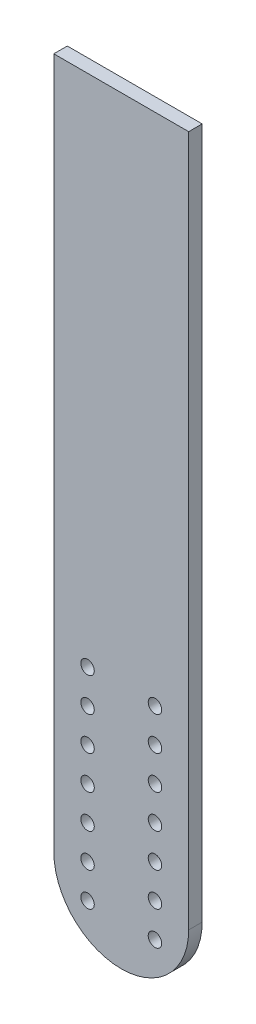
ISO-10303-21;
HEADER;
FILE_DESCRIPTION(('STEP AP214'),'2;1');
FILE_NAME('part.step','',(''),(''),'','','');
FILE_SCHEMA(('AUTOMOTIVE_DESIGN { 1 0 10303 214 1 1 1 1 }'));
ENDSEC;
DATA;
#1=APPLICATION_CONTEXT('core data for automotive mechanical design processes');
#2=APPLICATION_PROTOCOL_DEFINITION('international standard','automotive_design',2000,#1);
#3=PRODUCT_CONTEXT('',#1,'mechanical');
#4=PRODUCT('Part','Part','',(#3));
#5=PRODUCT_RELATED_PRODUCT_CATEGORY('part','',(#4));
#6=PRODUCT_DEFINITION_FORMATION('','',#4);
#7=PRODUCT_DEFINITION_CONTEXT('part definition',#1,'design');
#8=PRODUCT_DEFINITION('design','',#6,#7);
#9=PRODUCT_DEFINITION_SHAPE('','',#8);
#10=(LENGTH_UNIT() NAMED_UNIT(*) SI_UNIT(.MILLI.,.METRE.));
#11=(NAMED_UNIT(*) PLANE_ANGLE_UNIT() SI_UNIT($,.RADIAN.));
#12=(NAMED_UNIT(*) SI_UNIT($,.STERADIAN.) SOLID_ANGLE_UNIT());
#13=UNCERTAINTY_MEASURE_WITH_UNIT(LENGTH_MEASURE(1.E-05),#10,'distance_accuracy_value','');
#14=(GEOMETRIC_REPRESENTATION_CONTEXT(3) GLOBAL_UNCERTAINTY_ASSIGNED_CONTEXT((#13)) GLOBAL_UNIT_ASSIGNED_CONTEXT((#10,
#11,#12)) REPRESENTATION_CONTEXT('',''));
#15=CARTESIAN_POINT('',(0.,0.,0.));
#16=DIRECTION('',(0.,0.,1.));
#17=DIRECTION('',(1.,0.,0.));
#18=AXIS2_PLACEMENT_3D('',#15,#16,#17);
#19=CARTESIAN_POINT('',(9.99999999999997,-40.,0.));
#20=DIRECTION('',(0.,0.,1.));
#21=DIRECTION('',(1.,0.,0.));
#22=AXIS2_PLACEMENT_3D('',#19,#20,#21);
#23=CYLINDRICAL_SURFACE('',#22,2.);
#24=CARTESIAN_POINT('',(9.99999999999997,-40.,0.));
#25=DIRECTION('',(0.,0.,1.));
#26=DIRECTION('',(1.,0.,0.));
#27=AXIS2_PLACEMENT_3D('',#24,#25,#26);
#28=CIRCLE('',#27,2.);
#29=CARTESIAN_POINT('',(12.,-40.,0.));
#30=VERTEX_POINT('',#29);
#31=EDGE_CURVE('E201',#30,#30,#28,.T.);
#32=ORIENTED_EDGE('',*,*,#31,.F.);
#33=EDGE_LOOP('',(#32));
#34=FACE_BOUND('',#33,.T.);
#35=CARTESIAN_POINT('',(9.99999999999997,-40.,4.));
#36=DIRECTION('',(0.,0.,1.));
#37=DIRECTION('',(1.,0.,0.));
#38=AXIS2_PLACEMENT_3D('',#35,#36,#37);
#39=CIRCLE('',#38,2.);
#40=CARTESIAN_POINT('',(12.,-40.,4.));
#41=VERTEX_POINT('',#40);
#42=EDGE_CURVE('E205',#41,#41,#39,.T.);
#43=ORIENTED_EDGE('',*,*,#42,.T.);
#44=EDGE_LOOP('',(#43));
#45=FACE_BOUND('',#44,.T.);
#46=ADVANCED_FACE('F41',(#34,#45),#23,.F.);
#47=CARTESIAN_POINT('',(9.99999999999997,-50.,0.));
#48=DIRECTION('',(0.,0.,1.));
#49=DIRECTION('',(1.,0.,0.));
#50=AXIS2_PLACEMENT_3D('',#47,#48,#49);
#51=CYLINDRICAL_SURFACE('',#50,2.);
#52=CARTESIAN_POINT('',(9.99999999999997,-50.,0.));
#53=DIRECTION('',(0.,0.,1.));
#54=DIRECTION('',(1.,0.,0.));
#55=AXIS2_PLACEMENT_3D('',#52,#53,#54);
#56=CIRCLE('',#55,2.);
#57=CARTESIAN_POINT('',(12.,-50.,0.));
#58=VERTEX_POINT('',#57);
#59=EDGE_CURVE('E193',#58,#58,#56,.T.);
#60=ORIENTED_EDGE('',*,*,#59,.F.);
#61=EDGE_LOOP('',(#60));
#62=FACE_BOUND('',#61,.T.);
#63=CARTESIAN_POINT('',(9.99999999999997,-50.,4.));
#64=DIRECTION('',(0.,0.,1.));
#65=DIRECTION('',(1.,0.,0.));
#66=AXIS2_PLACEMENT_3D('',#63,#64,#65);
#67=CIRCLE('',#66,2.);
#68=CARTESIAN_POINT('',(12.,-50.,4.));
#69=VERTEX_POINT('',#68);
#70=EDGE_CURVE('E197',#69,#69,#67,.T.);
#71=ORIENTED_EDGE('',*,*,#70,.T.);
#72=EDGE_LOOP('',(#71));
#73=FACE_BOUND('',#72,.T.);
#74=ADVANCED_FACE('F278',(#62,#73),#51,.F.);
#75=CARTESIAN_POINT('',(9.99999999999997,-60.,0.));
#76=DIRECTION('',(0.,0.,1.));
#77=DIRECTION('',(1.,0.,0.));
#78=AXIS2_PLACEMENT_3D('',#75,#76,#77);
#79=CYLINDRICAL_SURFACE('',#78,2.);
#80=CARTESIAN_POINT('',(9.99999999999997,-60.,0.));
#81=DIRECTION('',(0.,0.,1.));
#82=DIRECTION('',(1.,0.,0.));
#83=AXIS2_PLACEMENT_3D('',#80,#81,#82);
#84=CIRCLE('',#83,2.);
#85=CARTESIAN_POINT('',(12.,-60.,0.));
#86=VERTEX_POINT('',#85);
#87=EDGE_CURVE('E185',#86,#86,#84,.T.);
#88=ORIENTED_EDGE('',*,*,#87,.F.);
#89=EDGE_LOOP('',(#88));
#90=FACE_BOUND('',#89,.T.);
#91=CARTESIAN_POINT('',(9.99999999999997,-60.,4.));
#92=DIRECTION('',(0.,0.,1.));
#93=DIRECTION('',(1.,0.,0.));
#94=AXIS2_PLACEMENT_3D('',#91,#92,#93);
#95=CIRCLE('',#94,2.);
#96=CARTESIAN_POINT('',(12.,-60.,4.));
#97=VERTEX_POINT('',#96);
#98=EDGE_CURVE('E189',#97,#97,#95,.T.);
#99=ORIENTED_EDGE('',*,*,#98,.T.);
#100=EDGE_LOOP('',(#99));
#101=FACE_BOUND('',#100,.T.);
#102=ADVANCED_FACE('F284',(#90,#101),#79,.F.);
#103=CARTESIAN_POINT('',(9.99999999999998,-70.,0.));
#104=DIRECTION('',(0.,0.,1.));
#105=DIRECTION('',(1.,0.,0.));
#106=AXIS2_PLACEMENT_3D('',#103,#104,#105);
#107=CYLINDRICAL_SURFACE('',#106,2.);
#108=CARTESIAN_POINT('',(9.99999999999998,-70.,0.));
#109=DIRECTION('',(0.,0.,1.));
#110=DIRECTION('',(1.,0.,0.));
#111=AXIS2_PLACEMENT_3D('',#108,#109,#110);
#112=CIRCLE('',#111,2.);
#113=CARTESIAN_POINT('',(12.,-70.,0.));
#114=VERTEX_POINT('',#113);
#115=EDGE_CURVE('E177',#114,#114,#112,.T.);
#116=ORIENTED_EDGE('',*,*,#115,.F.);
#117=EDGE_LOOP('',(#116));
#118=FACE_BOUND('',#117,.T.);
#119=CARTESIAN_POINT('',(9.99999999999998,-70.,4.));
#120=DIRECTION('',(0.,0.,1.));
#121=DIRECTION('',(1.,0.,0.));
#122=AXIS2_PLACEMENT_3D('',#119,#120,#121);
#123=CIRCLE('',#122,2.);
#124=CARTESIAN_POINT('',(12.,-70.,4.));
#125=VERTEX_POINT('',#124);
#126=EDGE_CURVE('E181',#125,#125,#123,.T.);
#127=ORIENTED_EDGE('',*,*,#126,.T.);
#128=EDGE_LOOP('',(#127));
#129=FACE_BOUND('',#128,.T.);
#130=ADVANCED_FACE('F393',(#118,#129),#107,.F.);
#131=CARTESIAN_POINT('',(9.99999999999998,-80.,0.));
#132=DIRECTION('',(0.,0.,1.));
#133=DIRECTION('',(1.,0.,0.));
#134=AXIS2_PLACEMENT_3D('',#131,#132,#133);
#135=CYLINDRICAL_SURFACE('',#134,2.);
#136=CARTESIAN_POINT('',(9.99999999999998,-80.,0.));
#137=DIRECTION('',(0.,0.,1.));
#138=DIRECTION('',(1.,0.,0.));
#139=AXIS2_PLACEMENT_3D('',#136,#137,#138);
#140=CIRCLE('',#139,2.);
#141=CARTESIAN_POINT('',(12.,-80.,0.));
#142=VERTEX_POINT('',#141);
#143=EDGE_CURVE('E169',#142,#142,#140,.T.);
#144=ORIENTED_EDGE('',*,*,#143,.F.);
#145=EDGE_LOOP('',(#144));
#146=FACE_BOUND('',#145,.T.);
#147=CARTESIAN_POINT('',(9.99999999999998,-80.,4.));
#148=DIRECTION('',(0.,0.,1.));
#149=DIRECTION('',(1.,0.,0.));
#150=AXIS2_PLACEMENT_3D('',#147,#148,#149);
#151=CIRCLE('',#150,2.);
#152=CARTESIAN_POINT('',(12.,-80.,4.));
#153=VERTEX_POINT('',#152);
#154=EDGE_CURVE('E173',#153,#153,#151,.T.);
#155=ORIENTED_EDGE('',*,*,#154,.T.);
#156=EDGE_LOOP('',(#155));
#157=FACE_BOUND('',#156,.T.);
#158=ADVANCED_FACE('F401',(#146,#157),#135,.F.);
#159=CARTESIAN_POINT('',(-10.,-40.,0.));
#160=DIRECTION('',(0.,0.,1.));
#161=DIRECTION('',(1.,0.,0.));
#162=AXIS2_PLACEMENT_3D('',#159,#160,#161);
#163=CYLINDRICAL_SURFACE('',#162,2.);
#164=CARTESIAN_POINT('',(-10.,-40.,0.));
#165=DIRECTION('',(0.,0.,1.));
#166=DIRECTION('',(1.,0.,0.));
#167=AXIS2_PLACEMENT_3D('',#164,#165,#166);
#168=CIRCLE('',#167,2.);
#169=CARTESIAN_POINT('',(-8.00000000000003,-40.,0.));
#170=VERTEX_POINT('',#169);
#171=EDGE_CURVE('E161',#170,#170,#168,.T.);
#172=ORIENTED_EDGE('',*,*,#171,.F.);
#173=EDGE_LOOP('',(#172));
#174=FACE_BOUND('',#173,.T.);
#175=CARTESIAN_POINT('',(-10.,-40.,4.));
#176=DIRECTION('',(0.,0.,1.));
#177=DIRECTION('',(1.,0.,0.));
#178=AXIS2_PLACEMENT_3D('',#175,#176,#177);
#179=CIRCLE('',#178,2.);
#180=CARTESIAN_POINT('',(-8.00000000000003,-40.,4.));
#181=VERTEX_POINT('',#180);
#182=EDGE_CURVE('E165',#181,#181,#179,.T.);
#183=ORIENTED_EDGE('',*,*,#182,.T.);
#184=EDGE_LOOP('',(#183));
#185=FACE_BOUND('',#184,.T.);
#186=ADVANCED_FACE('F410',(#174,#185),#163,.F.);
#187=CARTESIAN_POINT('',(-10.,-50.,0.));
#188=DIRECTION('',(0.,0.,1.));
#189=DIRECTION('',(1.,0.,0.));
#190=AXIS2_PLACEMENT_3D('',#187,#188,#189);
#191=CYLINDRICAL_SURFACE('',#190,2.);
#192=CARTESIAN_POINT('',(-10.,-50.,0.));
#193=DIRECTION('',(0.,0.,1.));
#194=DIRECTION('',(1.,0.,0.));
#195=AXIS2_PLACEMENT_3D('',#192,#193,#194);
#196=CIRCLE('',#195,2.);
#197=CARTESIAN_POINT('',(-8.00000000000003,-50.,0.));
#198=VERTEX_POINT('',#197);
#199=EDGE_CURVE('E153',#198,#198,#196,.T.);
#200=ORIENTED_EDGE('',*,*,#199,.F.);
#201=EDGE_LOOP('',(#200));
#202=FACE_BOUND('',#201,.T.);
#203=CARTESIAN_POINT('',(-10.,-50.,4.));
#204=DIRECTION('',(0.,0.,1.));
#205=DIRECTION('',(1.,0.,0.));
#206=AXIS2_PLACEMENT_3D('',#203,#204,#205);
#207=CIRCLE('',#206,2.);
#208=CARTESIAN_POINT('',(-8.00000000000003,-50.,4.));
#209=VERTEX_POINT('',#208);
#210=EDGE_CURVE('E157',#209,#209,#207,.T.);
#211=ORIENTED_EDGE('',*,*,#210,.T.);
#212=EDGE_LOOP('',(#211));
#213=FACE_BOUND('',#212,.T.);
#214=ADVANCED_FACE('F419',(#202,#213),#191,.F.);
#215=CARTESIAN_POINT('',(-10.,-60.,0.));
#216=DIRECTION('',(0.,0.,1.));
#217=DIRECTION('',(1.,0.,0.));
#218=AXIS2_PLACEMENT_3D('',#215,#216,#217);
#219=CYLINDRICAL_SURFACE('',#218,2.);
#220=CARTESIAN_POINT('',(-10.,-60.,0.));
#221=DIRECTION('',(0.,0.,1.));
#222=DIRECTION('',(1.,0.,0.));
#223=AXIS2_PLACEMENT_3D('',#220,#221,#222);
#224=CIRCLE('',#223,2.);
#225=CARTESIAN_POINT('',(-8.00000000000003,-60.,0.));
#226=VERTEX_POINT('',#225);
#227=EDGE_CURVE('E145',#226,#226,#224,.T.);
#228=ORIENTED_EDGE('',*,*,#227,.F.);
#229=EDGE_LOOP('',(#228));
#230=FACE_BOUND('',#229,.T.);
#231=CARTESIAN_POINT('',(-10.,-60.,4.));
#232=DIRECTION('',(0.,0.,1.));
#233=DIRECTION('',(1.,0.,0.));
#234=AXIS2_PLACEMENT_3D('',#231,#232,#233);
#235=CIRCLE('',#234,2.);
#236=CARTESIAN_POINT('',(-8.00000000000003,-60.,4.));
#237=VERTEX_POINT('',#236);
#238=EDGE_CURVE('E149',#237,#237,#235,.T.);
#239=ORIENTED_EDGE('',*,*,#238,.T.);
#240=EDGE_LOOP('',(#239));
#241=FACE_BOUND('',#240,.T.);
#242=ADVANCED_FACE('F428',(#230,#241),#219,.F.);
#243=CARTESIAN_POINT('',(-10.,-70.,0.));
#244=DIRECTION('',(0.,0.,1.));
#245=DIRECTION('',(1.,0.,0.));
#246=AXIS2_PLACEMENT_3D('',#243,#244,#245);
#247=CYLINDRICAL_SURFACE('',#246,2.);
#248=CARTESIAN_POINT('',(-10.,-70.,0.));
#249=DIRECTION('',(0.,0.,1.));
#250=DIRECTION('',(1.,0.,0.));
#251=AXIS2_PLACEMENT_3D('',#248,#249,#250);
#252=CIRCLE('',#251,2.);
#253=CARTESIAN_POINT('',(-8.00000000000002,-70.,0.));
#254=VERTEX_POINT('',#253);
#255=EDGE_CURVE('E137',#254,#254,#252,.T.);
#256=ORIENTED_EDGE('',*,*,#255,.F.);
#257=EDGE_LOOP('',(#256));
#258=FACE_BOUND('',#257,.T.);
#259=CARTESIAN_POINT('',(-10.,-70.,4.));
#260=DIRECTION('',(0.,0.,1.));
#261=DIRECTION('',(1.,0.,0.));
#262=AXIS2_PLACEMENT_3D('',#259,#260,#261);
#263=CIRCLE('',#262,2.);
#264=CARTESIAN_POINT('',(-8.00000000000002,-70.,4.));
#265=VERTEX_POINT('',#264);
#266=EDGE_CURVE('E141',#265,#265,#263,.T.);
#267=ORIENTED_EDGE('',*,*,#266,.T.);
#268=EDGE_LOOP('',(#267));
#269=FACE_BOUND('',#268,.T.);
#270=ADVANCED_FACE('F274',(#258,#269),#247,.F.);
#271=CARTESIAN_POINT('',(-10.,-80.,0.));
#272=DIRECTION('',(0.,0.,1.));
#273=DIRECTION('',(1.,0.,0.));
#274=AXIS2_PLACEMENT_3D('',#271,#272,#273);
#275=CYLINDRICAL_SURFACE('',#274,2.);
#276=CARTESIAN_POINT('',(-10.,-80.,0.));
#277=DIRECTION('',(0.,0.,1.));
#278=DIRECTION('',(1.,0.,0.));
#279=AXIS2_PLACEMENT_3D('',#276,#277,#278);
#280=CIRCLE('',#279,2.);
#281=CARTESIAN_POINT('',(-8.00000000000002,-80.,0.));
#282=VERTEX_POINT('',#281);
#283=EDGE_CURVE('E103',#282,#282,#280,.T.);
#284=ORIENTED_EDGE('',*,*,#283,.F.);
#285=EDGE_LOOP('',(#284));
#286=FACE_BOUND('',#285,.T.);
#287=CARTESIAN_POINT('',(-10.,-80.,4.));
#288=DIRECTION('',(0.,0.,1.));
#289=DIRECTION('',(1.,0.,0.));
#290=AXIS2_PLACEMENT_3D('',#287,#288,#289);
#291=CIRCLE('',#290,2.);
#292=CARTESIAN_POINT('',(-8.00000000000002,-80.,4.));
#293=VERTEX_POINT('',#292);
#294=EDGE_CURVE('E133',#293,#293,#291,.T.);
#295=ORIENTED_EDGE('',*,*,#294,.T.);
#296=EDGE_LOOP('',(#295));
#297=FACE_BOUND('',#296,.T.);
#298=ADVANCED_FACE('F267',(#286,#297),#275,.F.);
#299=CARTESIAN_POINT('',(-20.,112.5,4.));
#300=DIRECTION('',(1.,0.,0.));
#301=DIRECTION('',(0.,1.,0.));
#302=AXIS2_PLACEMENT_3D('',#299,#300,#301);
#303=PLANE('',#302);
#304=DIRECTION('',(0.,-1.,0.));
#305=VECTOR('',#304,1.);
#306=CARTESIAN_POINT('',(-20.,112.5,0.));
#307=LINE('',#306,#305);
#308=CARTESIAN_POINT('',(-20.,112.5,0.));
#309=VERTEX_POINT('',#308);
#310=CARTESIAN_POINT('',(-20.,-92.5,0.));
#311=VERTEX_POINT('',#310);
#312=EDGE_CURVE('E121',#309,#311,#307,.T.);
#313=ORIENTED_EDGE('',*,*,#312,.T.);
#314=DIRECTION('',(0.,0.,-1.));
#315=VECTOR('',#314,1.);
#316=CARTESIAN_POINT('',(-20.,-92.5,4.));
#317=LINE('',#316,#315);
#318=CARTESIAN_POINT('',(-20.,-92.5,4.));
#319=VERTEX_POINT('',#318);
#320=EDGE_CURVE('E11',#311,#319,#317,.F.);
#321=ORIENTED_EDGE('',*,*,#320,.T.);
#322=DIRECTION('',(0.,-1.,0.));
#323=VECTOR('',#322,1.);
#324=CARTESIAN_POINT('',(-20.,112.5,4.));
#325=LINE('',#324,#323);
#326=CARTESIAN_POINT('',(-20.,112.5,4.));
#327=VERTEX_POINT('',#326);
#328=EDGE_CURVE('E112',#327,#319,#325,.T.);
#329=ORIENTED_EDGE('',*,*,#328,.F.);
#330=DIRECTION('',(0.,0.,-1.));
#331=VECTOR('',#330,1.);
#332=CARTESIAN_POINT('',(-20.,112.5,4.));
#333=LINE('',#332,#331);
#334=EDGE_CURVE('E104',#327,#309,#333,.T.);
#335=ORIENTED_EDGE('',*,*,#334,.T.);
#336=EDGE_LOOP('',(#313,#321,#329,#335));
#337=FACE_BOUND('',#336,.T.);
#338=ADVANCED_FACE('F265',(#337),#303,.F.);
#339=CARTESIAN_POINT('',(20.,112.5,4.));
#340=DIRECTION('',(1.,0.,0.));
#341=DIRECTION('',(0.,1.,0.));
#342=AXIS2_PLACEMENT_3D('',#339,#340,#341);
#343=PLANE('',#342);
#344=DIRECTION('',(0.,-1.,0.));
#345=VECTOR('',#344,1.);
#346=CARTESIAN_POINT('',(20.,112.5,4.));
#347=LINE('',#346,#345);
#348=CARTESIAN_POINT('',(20.,112.5,4.));
#349=VERTEX_POINT('',#348);
#350=CARTESIAN_POINT('',(20.,-92.5,4.));
#351=VERTEX_POINT('',#350);
#352=EDGE_CURVE('E94',#349,#351,#347,.T.);
#353=ORIENTED_EDGE('',*,*,#352,.T.);
#354=DIRECTION('',(0.,0.,-1.));
#355=VECTOR('',#354,1.);
#356=CARTESIAN_POINT('',(20.,-92.5,0.));
#357=LINE('',#356,#355);
#358=CARTESIAN_POINT('',(20.,-92.5,0.));
#359=VERTEX_POINT('',#358);
#360=EDGE_CURVE('E209',#351,#359,#357,.T.);
#361=ORIENTED_EDGE('',*,*,#360,.T.);
#362=DIRECTION('',(0.,-1.,0.));
#363=VECTOR('',#362,1.);
#364=CARTESIAN_POINT('',(20.,112.5,0.));
#365=LINE('',#364,#363);
#366=CARTESIAN_POINT('',(20.,112.5,0.));
#367=VERTEX_POINT('',#366);
#368=EDGE_CURVE('E97',#367,#359,#365,.T.);
#369=ORIENTED_EDGE('',*,*,#368,.F.);
#370=DIRECTION('',(0.,0.,-1.));
#371=VECTOR('',#370,1.);
#372=CARTESIAN_POINT('',(20.,112.5,4.));
#373=LINE('',#372,#371);
#374=EDGE_CURVE('E90',#349,#367,#373,.T.);
#375=ORIENTED_EDGE('',*,*,#374,.F.);
#376=EDGE_LOOP('',(#353,#361,#369,#375));
#377=FACE_BOUND('',#376,.T.);
#378=ADVANCED_FACE('F92',(#377),#343,.T.);
#379=CARTESIAN_POINT('',(-20.,112.5,4.));
#380=DIRECTION('',(0.,1.,0.));
#381=DIRECTION('',(0.,0.,1.));
#382=AXIS2_PLACEMENT_3D('',#379,#380,#381);
#383=PLANE('',#382);
#384=DIRECTION('',(1.,0.,0.));
#385=VECTOR('',#384,1.);
#386=CARTESIAN_POINT('',(-20.,112.5,0.));
#387=LINE('',#386,#385);
#388=EDGE_CURVE('E127',#309,#367,#387,.T.);
#389=ORIENTED_EDGE('',*,*,#388,.F.);
#390=ORIENTED_EDGE('',*,*,#334,.F.);
#391=DIRECTION('',(1.,0.,0.));
#392=VECTOR('',#391,1.);
#393=CARTESIAN_POINT('',(-20.,112.5,4.));
#394=LINE('',#393,#392);
#395=EDGE_CURVE('E109',#327,#349,#394,.T.);
#396=ORIENTED_EDGE('',*,*,#395,.T.);
#397=ORIENTED_EDGE('',*,*,#374,.T.);
#398=EDGE_LOOP('',(#389,#390,#396,#397));
#399=FACE_BOUND('',#398,.T.);
#400=ADVANCED_FACE('F114',(#399),#383,.T.);
#401=CARTESIAN_POINT('',(0.,0.,4.));
#402=DIRECTION('',(0.,0.,1.));
#403=DIRECTION('',(1.,0.,0.));
#404=AXIS2_PLACEMENT_3D('',#401,#402,#403);
#405=PLANE('',#404);
#406=CARTESIAN_POINT('',(9.99999999999998,-90.,4.));
#407=DIRECTION('',(0.,0.,1.));
#408=DIRECTION('',(1.,0.,0.));
#409=AXIS2_PLACEMENT_3D('',#406,#407,#408);
#410=CIRCLE('',#409,2.);
#411=CARTESIAN_POINT('',(12.,-90.,4.));
#412=VERTEX_POINT('',#411);
#413=EDGE_CURVE('E234',#412,#412,#410,.T.);
#414=ORIENTED_EDGE('',*,*,#413,.F.);
#415=EDGE_LOOP('',(#414));
#416=FACE_BOUND('',#415,.T.);
#417=CARTESIAN_POINT('',(-10.,-90.,4.));
#418=DIRECTION('',(0.,0.,1.));
#419=DIRECTION('',(1.,0.,0.));
#420=AXIS2_PLACEMENT_3D('',#417,#418,#419);
#421=CIRCLE('',#420,2.);
#422=CARTESIAN_POINT('',(-8.00000000000002,-90.,4.));
#423=VERTEX_POINT('',#422);
#424=EDGE_CURVE('E246',#423,#423,#421,.T.);
#425=ORIENTED_EDGE('',*,*,#424,.F.);
#426=EDGE_LOOP('',(#425));
#427=FACE_BOUND('',#426,.T.);
#428=CARTESIAN_POINT('',(-10.,-100.,4.));
#429=DIRECTION('',(0.,0.,1.));
#430=DIRECTION('',(1.,0.,0.));
#431=AXIS2_PLACEMENT_3D('',#428,#429,#430);
#432=CIRCLE('',#431,2.);
#433=CARTESIAN_POINT('',(-8.00000000000002,-100.,4.));
#434=VERTEX_POINT('',#433);
#435=EDGE_CURVE('E254',#434,#434,#432,.T.);
#436=ORIENTED_EDGE('',*,*,#435,.F.);
#437=EDGE_LOOP('',(#436));
#438=FACE_BOUND('',#437,.T.);
#439=CARTESIAN_POINT('',(9.99999999999998,-100.,4.));
#440=DIRECTION('',(0.,0.,1.));
#441=DIRECTION('',(1.,0.,0.));
#442=AXIS2_PLACEMENT_3D('',#439,#440,#441);
#443=CIRCLE('',#442,2.);
#444=CARTESIAN_POINT('',(12.,-100.,4.));
#445=VERTEX_POINT('',#444);
#446=EDGE_CURVE('E250',#445,#445,#443,.T.);
#447=ORIENTED_EDGE('',*,*,#446,.F.);
#448=EDGE_LOOP('',(#447));
#449=FACE_BOUND('',#448,.T.);
#450=CARTESIAN_POINT('',(0.,-92.5,4.));
#451=DIRECTION('',(0.,0.,1.));
#452=DIRECTION('',(1.,0.,0.));
#453=AXIS2_PLACEMENT_3D('',#450,#451,#452);
#454=CIRCLE('',#453,20.);
#455=CARTESIAN_POINT('',(0.,-112.5,4.));
#456=VERTEX_POINT('',#455);
#457=EDGE_CURVE('E58',#319,#456,#454,.T.);
#458=ORIENTED_EDGE('',*,*,#457,.T.);
#459=CARTESIAN_POINT('',(0.,-92.5,4.));
#460=DIRECTION('',(0.,0.,1.));
#461=DIRECTION('',(1.,0.,0.));
#462=AXIS2_PLACEMENT_3D('',#459,#460,#461);
#463=CIRCLE('',#462,20.);
#464=EDGE_CURVE('E51',#456,#351,#463,.T.);
#465=ORIENTED_EDGE('',*,*,#464,.T.);
#466=ORIENTED_EDGE('',*,*,#352,.F.);
#467=ORIENTED_EDGE('',*,*,#395,.F.);
#468=ORIENTED_EDGE('',*,*,#328,.T.);
#469=EDGE_LOOP('',(#458,#465,#466,#467,#468));
#470=FACE_BOUND('',#469,.T.);
#471=ORIENTED_EDGE('',*,*,#294,.F.);
#472=EDGE_LOOP('',(#471));
#473=FACE_BOUND('',#472,.T.);
#474=ORIENTED_EDGE('',*,*,#266,.F.);
#475=EDGE_LOOP('',(#474));
#476=FACE_BOUND('',#475,.T.);
#477=ORIENTED_EDGE('',*,*,#238,.F.);
#478=EDGE_LOOP('',(#477));
#479=FACE_BOUND('',#478,.T.);
#480=ORIENTED_EDGE('',*,*,#210,.F.);
#481=EDGE_LOOP('',(#480));
#482=FACE_BOUND('',#481,.T.);
#483=ORIENTED_EDGE('',*,*,#182,.F.);
#484=EDGE_LOOP('',(#483));
#485=FACE_BOUND('',#484,.T.);
#486=ORIENTED_EDGE('',*,*,#154,.F.);
#487=EDGE_LOOP('',(#486));
#488=FACE_BOUND('',#487,.T.);
#489=ORIENTED_EDGE('',*,*,#126,.F.);
#490=EDGE_LOOP('',(#489));
#491=FACE_BOUND('',#490,.T.);
#492=ORIENTED_EDGE('',*,*,#98,.F.);
#493=EDGE_LOOP('',(#492));
#494=FACE_BOUND('',#493,.T.);
#495=ORIENTED_EDGE('',*,*,#70,.F.);
#496=EDGE_LOOP('',(#495));
#497=FACE_BOUND('',#496,.T.);
#498=ORIENTED_EDGE('',*,*,#42,.F.);
#499=EDGE_LOOP('',(#498));
#500=FACE_BOUND('',#499,.T.);
#501=ADVANCED_FACE('F107',(#416,#427,#438,#449,#470,#473,#476,#479,#482,#485,#488,#491,#494,
#497,#500),#405,.T.);
#502=CARTESIAN_POINT('',(0.,0.,0.));
#503=DIRECTION('',(0.,0.,1.));
#504=DIRECTION('',(1.,0.,0.));
#505=AXIS2_PLACEMENT_3D('',#502,#503,#504);
#506=PLANE('',#505);
#507=CARTESIAN_POINT('',(9.99999999999998,-90.,0.));
#508=DIRECTION('',(0.,0.,1.));
#509=DIRECTION('',(1.,0.,0.));
#510=AXIS2_PLACEMENT_3D('',#507,#508,#509);
#511=CIRCLE('',#510,2.);
#512=CARTESIAN_POINT('',(12.,-90.,0.));
#513=VERTEX_POINT('',#512);
#514=EDGE_CURVE('E231',#513,#513,#511,.T.);
#515=ORIENTED_EDGE('',*,*,#514,.T.);
#516=EDGE_LOOP('',(#515));
#517=FACE_BOUND('',#516,.T.);
#518=CARTESIAN_POINT('',(-10.,-90.,0.));
#519=DIRECTION('',(0.,0.,1.));
#520=DIRECTION('',(1.,0.,0.));
#521=AXIS2_PLACEMENT_3D('',#518,#519,#520);
#522=CIRCLE('',#521,2.);
#523=CARTESIAN_POINT('',(-8.00000000000002,-90.,0.));
#524=VERTEX_POINT('',#523);
#525=EDGE_CURVE('E240',#524,#524,#522,.T.);
#526=ORIENTED_EDGE('',*,*,#525,.T.);
#527=EDGE_LOOP('',(#526));
#528=FACE_BOUND('',#527,.T.);
#529=CARTESIAN_POINT('',(-10.,-100.,0.));
#530=DIRECTION('',(0.,0.,1.));
#531=DIRECTION('',(1.,0.,0.));
#532=AXIS2_PLACEMENT_3D('',#529,#530,#531);
#533=CIRCLE('',#532,2.);
#534=CARTESIAN_POINT('',(-8.00000000000002,-100.,0.));
#535=VERTEX_POINT('',#534);
#536=EDGE_CURVE('E124',#535,#535,#533,.T.);
#537=ORIENTED_EDGE('',*,*,#536,.T.);
#538=EDGE_LOOP('',(#537));
#539=FACE_BOUND('',#538,.T.);
#540=CARTESIAN_POINT('',(9.99999999999998,-100.,0.));
#541=DIRECTION('',(0.,0.,1.));
#542=DIRECTION('',(1.,0.,0.));
#543=AXIS2_PLACEMENT_3D('',#540,#541,#542);
#544=CIRCLE('',#543,2.);
#545=CARTESIAN_POINT('',(12.,-100.,0.));
#546=VERTEX_POINT('',#545);
#547=EDGE_CURVE('E258',#546,#546,#544,.T.);
#548=ORIENTED_EDGE('',*,*,#547,.T.);
#549=EDGE_LOOP('',(#548));
#550=FACE_BOUND('',#549,.T.);
#551=ORIENTED_EDGE('',*,*,#368,.T.);
#552=CARTESIAN_POINT('',(0.,-92.5,0.));
#553=DIRECTION('',(0.,0.,1.));
#554=DIRECTION('',(1.,0.,0.));
#555=AXIS2_PLACEMENT_3D('',#552,#553,#554);
#556=CIRCLE('',#555,20.);
#557=CARTESIAN_POINT('',(0.,-112.5,0.));
#558=VERTEX_POINT('',#557);
#559=EDGE_CURVE('E215',#359,#558,#556,.F.);
#560=ORIENTED_EDGE('',*,*,#559,.T.);
#561=CARTESIAN_POINT('',(0.,-92.5,0.));
#562=DIRECTION('',(0.,0.,1.));
#563=DIRECTION('',(1.,0.,0.));
#564=AXIS2_PLACEMENT_3D('',#561,#562,#563);
#565=CIRCLE('',#564,20.);
#566=EDGE_CURVE('E212',#558,#311,#565,.F.);
#567=ORIENTED_EDGE('',*,*,#566,.T.);
#568=ORIENTED_EDGE('',*,*,#312,.F.);
#569=ORIENTED_EDGE('',*,*,#388,.T.);
#570=EDGE_LOOP('',(#551,#560,#567,#568,#569));
#571=FACE_BOUND('',#570,.T.);
#572=ORIENTED_EDGE('',*,*,#283,.T.);
#573=EDGE_LOOP('',(#572));
#574=FACE_BOUND('',#573,.T.);
#575=ORIENTED_EDGE('',*,*,#255,.T.);
#576=EDGE_LOOP('',(#575));
#577=FACE_BOUND('',#576,.T.);
#578=ORIENTED_EDGE('',*,*,#227,.T.);
#579=EDGE_LOOP('',(#578));
#580=FACE_BOUND('',#579,.T.);
#581=ORIENTED_EDGE('',*,*,#199,.T.);
#582=EDGE_LOOP('',(#581));
#583=FACE_BOUND('',#582,.T.);
#584=ORIENTED_EDGE('',*,*,#171,.T.);
#585=EDGE_LOOP('',(#584));
#586=FACE_BOUND('',#585,.T.);
#587=ORIENTED_EDGE('',*,*,#143,.T.);
#588=EDGE_LOOP('',(#587));
#589=FACE_BOUND('',#588,.T.);
#590=ORIENTED_EDGE('',*,*,#115,.T.);
#591=EDGE_LOOP('',(#590));
#592=FACE_BOUND('',#591,.T.);
#593=ORIENTED_EDGE('',*,*,#87,.T.);
#594=EDGE_LOOP('',(#593));
#595=FACE_BOUND('',#594,.T.);
#596=ORIENTED_EDGE('',*,*,#59,.T.);
#597=EDGE_LOOP('',(#596));
#598=FACE_BOUND('',#597,.T.);
#599=ORIENTED_EDGE('',*,*,#31,.T.);
#600=EDGE_LOOP('',(#599));
#601=FACE_BOUND('',#600,.T.);
#602=ADVANCED_FACE('F223',(#517,#528,#539,#550,#571,#574,#577,#580,#583,#586,#589,#592,#595,
#598,#601),#506,.F.);
#603=CARTESIAN_POINT('',(9.99999999999998,-100.,0.));
#604=DIRECTION('',(0.,0.,1.));
#605=DIRECTION('',(1.,0.,0.));
#606=AXIS2_PLACEMENT_3D('',#603,#604,#605);
#607=CYLINDRICAL_SURFACE('',#606,2.);
#608=ORIENTED_EDGE('',*,*,#547,.F.);
#609=EDGE_LOOP('',(#608));
#610=FACE_BOUND('',#609,.T.);
#611=ORIENTED_EDGE('',*,*,#446,.T.);
#612=EDGE_LOOP('',(#611));
#613=FACE_BOUND('',#612,.T.);
#614=ADVANCED_FACE('F311',(#610,#613),#607,.F.);
#615=CARTESIAN_POINT('',(-10.,-100.,0.));
#616=DIRECTION('',(0.,0.,1.));
#617=DIRECTION('',(1.,0.,0.));
#618=AXIS2_PLACEMENT_3D('',#615,#616,#617);
#619=CYLINDRICAL_SURFACE('',#618,2.);
#620=ORIENTED_EDGE('',*,*,#536,.F.);
#621=EDGE_LOOP('',(#620));
#622=FACE_BOUND('',#621,.T.);
#623=ORIENTED_EDGE('',*,*,#435,.T.);
#624=EDGE_LOOP('',(#623));
#625=FACE_BOUND('',#624,.T.);
#626=ADVANCED_FACE('F304',(#622,#625),#619,.F.);
#627=CARTESIAN_POINT('',(-10.,-90.,0.));
#628=DIRECTION('',(0.,0.,1.));
#629=DIRECTION('',(1.,0.,0.));
#630=AXIS2_PLACEMENT_3D('',#627,#628,#629);
#631=CYLINDRICAL_SURFACE('',#630,2.);
#632=ORIENTED_EDGE('',*,*,#525,.F.);
#633=EDGE_LOOP('',(#632));
#634=FACE_BOUND('',#633,.T.);
#635=ORIENTED_EDGE('',*,*,#424,.T.);
#636=EDGE_LOOP('',(#635));
#637=FACE_BOUND('',#636,.T.);
#638=ADVANCED_FACE('F298',(#634,#637),#631,.F.);
#639=CARTESIAN_POINT('',(9.99999999999998,-90.,0.));
#640=DIRECTION('',(0.,0.,1.));
#641=DIRECTION('',(1.,0.,0.));
#642=AXIS2_PLACEMENT_3D('',#639,#640,#641);
#643=CYLINDRICAL_SURFACE('',#642,2.);
#644=ORIENTED_EDGE('',*,*,#514,.F.);
#645=EDGE_LOOP('',(#644));
#646=FACE_BOUND('',#645,.T.);
#647=ORIENTED_EDGE('',*,*,#413,.T.);
#648=EDGE_LOOP('',(#647));
#649=FACE_BOUND('',#648,.T.);
#650=ADVANCED_FACE('F294',(#646,#649),#643,.F.);
#651=CARTESIAN_POINT('',(0.,-92.5,4.));
#652=DIRECTION('',(0.,0.,-1.));
#653=DIRECTION('',(-1.,0.,0.));
#654=AXIS2_PLACEMENT_3D('',#651,#652,#653);
#655=CYLINDRICAL_SURFACE('',#654,20.);
#656=DIRECTION('',(0.,0.,-1.));
#657=VECTOR('',#656,1.);
#658=CARTESIAN_POINT('',(0.,-112.5,4.));
#659=LINE('',#658,#657);
#660=EDGE_CURVE('E45',#456,#558,#659,.T.);
#661=ORIENTED_EDGE('',*,*,#660,.F.);
#662=ORIENTED_EDGE('',*,*,#457,.F.);
#663=ORIENTED_EDGE('',*,*,#320,.F.);
#664=ORIENTED_EDGE('',*,*,#566,.F.);
#665=EDGE_LOOP('',(#661,#662,#663,#664));
#666=FACE_BOUND('',#665,.T.);
#667=ADVANCED_FACE('F43',(#666),#655,.T.);
#668=CARTESIAN_POINT('',(0.,-92.5,4.));
#669=DIRECTION('',(0.,0.,1.));
#670=DIRECTION('',(1.,0.,0.));
#671=AXIS2_PLACEMENT_3D('',#668,#669,#670);
#672=CYLINDRICAL_SURFACE('',#671,20.);
#673=ORIENTED_EDGE('',*,*,#464,.F.);
#674=ORIENTED_EDGE('',*,*,#660,.T.);
#675=ORIENTED_EDGE('',*,*,#559,.F.);
#676=ORIENTED_EDGE('',*,*,#360,.F.);
#677=EDGE_LOOP('',(#673,#674,#675,#676));
#678=FACE_BOUND('',#677,.T.);
#679=ADVANCED_FACE('F229',(#678),#672,.T.);
#680=CLOSED_SHELL('',(#46,#74,#102,#130,#158,#186,#214,#242,#270,#298,#338,#378,#400,#501,#602,
#614,#626,#638,#650,#667,#679));
#681=MANIFOLD_SOLID_BREP('B2',#680);
#682=ADVANCED_BREP_SHAPE_REPRESENTATION('',(#18,#681),#14);
#683=SHAPE_DEFINITION_REPRESENTATION(#9,#682);
ENDSEC;
END-ISO-10303-21;
